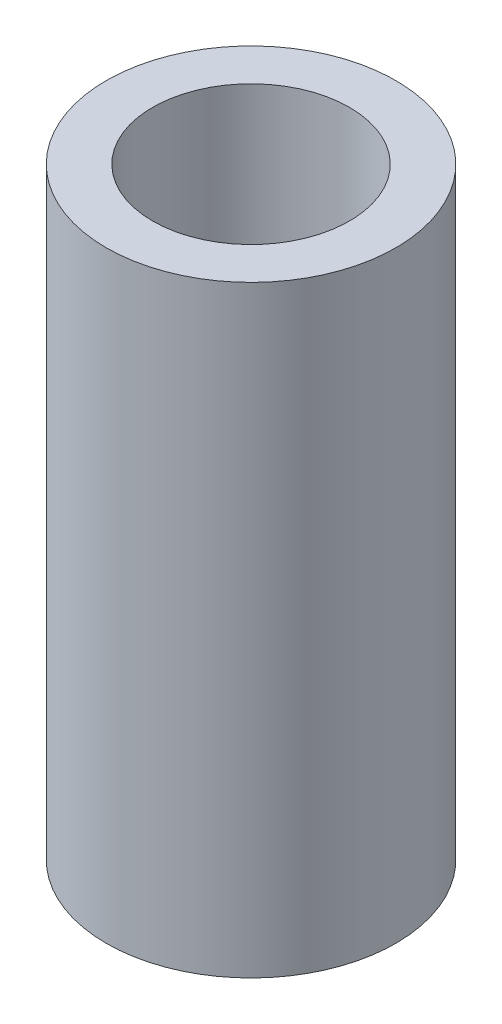
ISO-10303-21;
HEADER;
FILE_DESCRIPTION(('STEP AP214'),'2;1');
FILE_NAME('part.step','',(''),(''),'','','');
FILE_SCHEMA(('AUTOMOTIVE_DESIGN { 1 0 10303 214 1 1 1 1 }'));
ENDSEC;
DATA;
#1=APPLICATION_CONTEXT('core data for automotive mechanical design processes');
#2=APPLICATION_PROTOCOL_DEFINITION('international standard','automotive_design',2000,#1);
#3=PRODUCT_CONTEXT('',#1,'mechanical');
#4=PRODUCT('Part','Part','',(#3));
#5=PRODUCT_RELATED_PRODUCT_CATEGORY('part','',(#4));
#6=PRODUCT_DEFINITION_FORMATION('','',#4);
#7=PRODUCT_DEFINITION_CONTEXT('part definition',#1,'design');
#8=PRODUCT_DEFINITION('design','',#6,#7);
#9=PRODUCT_DEFINITION_SHAPE('','',#8);
#10=(LENGTH_UNIT() NAMED_UNIT(*) SI_UNIT(.MILLI.,.METRE.));
#11=(NAMED_UNIT(*) PLANE_ANGLE_UNIT() SI_UNIT($,.RADIAN.));
#12=(NAMED_UNIT(*) SI_UNIT($,.STERADIAN.) SOLID_ANGLE_UNIT());
#13=UNCERTAINTY_MEASURE_WITH_UNIT(LENGTH_MEASURE(1.E-05),#10,'distance_accuracy_value','');
#14=(GEOMETRIC_REPRESENTATION_CONTEXT(3) GLOBAL_UNCERTAINTY_ASSIGNED_CONTEXT((#13)) GLOBAL_UNIT_ASSIGNED_CONTEXT((#10,
#11,#12)) REPRESENTATION_CONTEXT('',''));
#15=CARTESIAN_POINT('',(0.,0.,0.));
#16=DIRECTION('',(0.,0.,1.));
#17=DIRECTION('',(1.,0.,0.));
#18=AXIS2_PLACEMENT_3D('',#15,#16,#17);
#19=CARTESIAN_POINT('',(0.,52.,0.));
#20=DIRECTION('',(0.,1.,0.));
#21=DIRECTION('',(0.,0.,1.));
#22=AXIS2_PLACEMENT_3D('',#19,#20,#21);
#23=PLANE('',#22);
#24=CARTESIAN_POINT('',(0.,52.,0.));
#25=DIRECTION('',(0.,1.,0.));
#26=DIRECTION('',(0.,0.,1.));
#27=AXIS2_PLACEMENT_3D('',#24,#25,#26);
#28=CIRCLE('',#27,12.5);
#29=CARTESIAN_POINT('',(0.,52.,12.5));
#30=VERTEX_POINT('',#29);
#31=EDGE_CURVE('E10',#30,#30,#28,.T.);
#32=ORIENTED_EDGE('',*,*,#31,.T.);
#33=EDGE_LOOP('',(#32));
#34=FACE_BOUND('',#33,.T.);
#35=CARTESIAN_POINT('',(0.,52.,0.));
#36=DIRECTION('',(0.,1.,0.));
#37=DIRECTION('',(0.,0.,1.));
#38=AXIS2_PLACEMENT_3D('',#35,#36,#37);
#39=CIRCLE('',#38,8.5);
#40=CARTESIAN_POINT('',(0.,52.,8.5));
#41=VERTEX_POINT('',#40);
#42=EDGE_CURVE('E50',#41,#41,#39,.T.);
#43=ORIENTED_EDGE('',*,*,#42,.F.);
#44=EDGE_LOOP('',(#43));
#45=FACE_BOUND('',#44,.T.);
#46=ADVANCED_FACE('F39',(#34,#45),#23,.T.);
#47=CARTESIAN_POINT('',(0.,0.,0.));
#48=DIRECTION('',(0.,1.,0.));
#49=DIRECTION('',(0.,0.,1.));
#50=AXIS2_PLACEMENT_3D('',#47,#48,#49);
#51=PLANE('',#50);
#52=CARTESIAN_POINT('',(0.,0.,0.));
#53=DIRECTION('',(0.,1.,0.));
#54=DIRECTION('',(0.,0.,1.));
#55=AXIS2_PLACEMENT_3D('',#52,#53,#54);
#56=CIRCLE('',#55,12.5);
#57=CARTESIAN_POINT('',(0.,0.,12.5));
#58=VERTEX_POINT('',#57);
#59=EDGE_CURVE('E43',#58,#58,#56,.T.);
#60=ORIENTED_EDGE('',*,*,#59,.F.);
#61=EDGE_LOOP('',(#60));
#62=FACE_BOUND('',#61,.T.);
#63=CARTESIAN_POINT('',(0.,0.,0.));
#64=DIRECTION('',(0.,1.,0.));
#65=DIRECTION('',(0.,0.,1.));
#66=AXIS2_PLACEMENT_3D('',#63,#64,#65);
#67=CIRCLE('',#66,8.5);
#68=CARTESIAN_POINT('',(0.,0.,8.5));
#69=VERTEX_POINT('',#68);
#70=EDGE_CURVE('E52',#69,#69,#67,.T.);
#71=ORIENTED_EDGE('',*,*,#70,.T.);
#72=EDGE_LOOP('',(#71));
#73=FACE_BOUND('',#72,.T.);
#74=ADVANCED_FACE('F62',(#62,#73),#51,.F.);
#75=CARTESIAN_POINT('',(0.,52.,0.));
#76=DIRECTION('',(0.,-1.,0.));
#77=DIRECTION('',(0.,0.,-1.));
#78=AXIS2_PLACEMENT_3D('',#75,#76,#77);
#79=CYLINDRICAL_SURFACE('',#78,12.5);
#80=ORIENTED_EDGE('',*,*,#31,.F.);
#81=EDGE_LOOP('',(#80));
#82=FACE_BOUND('',#81,.T.);
#83=ORIENTED_EDGE('',*,*,#59,.T.);
#84=EDGE_LOOP('',(#83));
#85=FACE_BOUND('',#84,.T.);
#86=ADVANCED_FACE('F41',(#82,#85),#79,.T.);
#87=CARTESIAN_POINT('',(0.,52.,0.));
#88=DIRECTION('',(0.,-1.,0.));
#89=DIRECTION('',(0.,0.,-1.));
#90=AXIS2_PLACEMENT_3D('',#87,#88,#89);
#91=CYLINDRICAL_SURFACE('',#90,8.5);
#92=ORIENTED_EDGE('',*,*,#42,.T.);
#93=EDGE_LOOP('',(#92));
#94=FACE_BOUND('',#93,.T.);
#95=ORIENTED_EDGE('',*,*,#70,.F.);
#96=EDGE_LOOP('',(#95));
#97=FACE_BOUND('',#96,.T.);
#98=ADVANCED_FACE('F58',(#94,#97),#91,.F.);
#99=CLOSED_SHELL('',(#46,#74,#86,#98));
#100=MANIFOLD_SOLID_BREP('B2',#99);
#101=ADVANCED_BREP_SHAPE_REPRESENTATION('',(#18,#100),#14);
#102=SHAPE_DEFINITION_REPRESENTATION(#9,#101);
ENDSEC;
END-ISO-10303-21;
